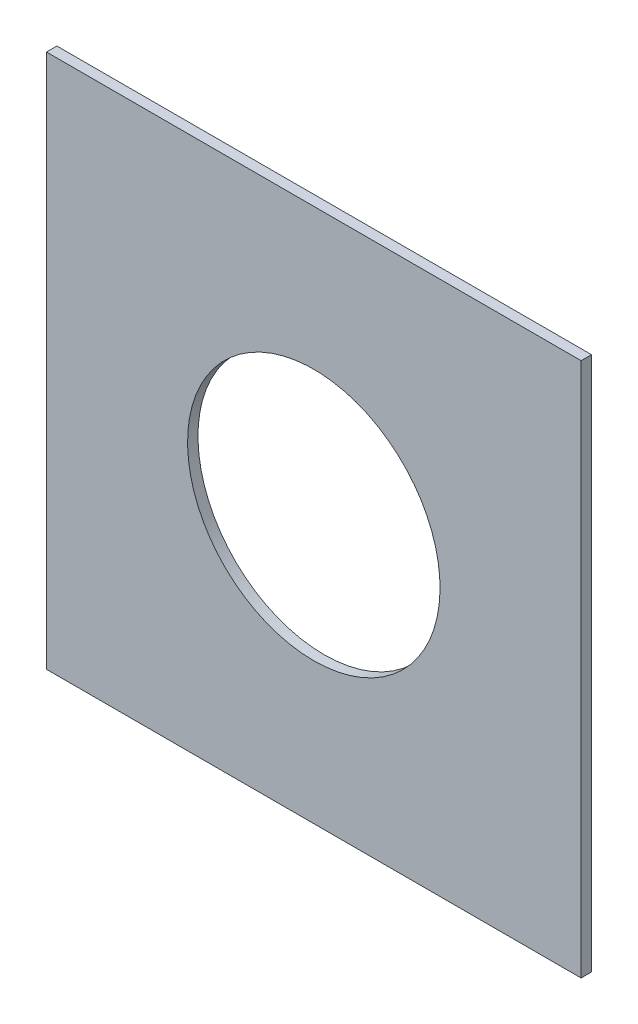
ISO-10303-21;
HEADER;
FILE_DESCRIPTION(('STEP AP214'),'2;1');
FILE_NAME('part.step','',(''),(''),'','','');
FILE_SCHEMA(('AUTOMOTIVE_DESIGN { 1 0 10303 214 1 1 1 1 }'));
ENDSEC;
DATA;
#1=APPLICATION_CONTEXT('core data for automotive mechanical design processes');
#2=APPLICATION_PROTOCOL_DEFINITION('international standard','automotive_design',2000,#1);
#3=PRODUCT_CONTEXT('',#1,'mechanical');
#4=PRODUCT('Part','Part','',(#3));
#5=PRODUCT_RELATED_PRODUCT_CATEGORY('part','',(#4));
#6=PRODUCT_DEFINITION_FORMATION('','',#4);
#7=PRODUCT_DEFINITION_CONTEXT('part definition',#1,'design');
#8=PRODUCT_DEFINITION('design','',#6,#7);
#9=PRODUCT_DEFINITION_SHAPE('','',#8);
#10=(LENGTH_UNIT() NAMED_UNIT(*) SI_UNIT(.MILLI.,.METRE.));
#11=(NAMED_UNIT(*) PLANE_ANGLE_UNIT() SI_UNIT($,.RADIAN.));
#12=(NAMED_UNIT(*) SI_UNIT($,.STERADIAN.) SOLID_ANGLE_UNIT());
#13=UNCERTAINTY_MEASURE_WITH_UNIT(LENGTH_MEASURE(1.E-05),#10,'distance_accuracy_value','');
#14=(GEOMETRIC_REPRESENTATION_CONTEXT(3) GLOBAL_UNCERTAINTY_ASSIGNED_CONTEXT((#13)) GLOBAL_UNIT_ASSIGNED_CONTEXT((#10,
#11,#12)) REPRESENTATION_CONTEXT('',''));
#15=CARTESIAN_POINT('',(0.,0.,0.));
#16=DIRECTION('',(0.,0.,1.));
#17=DIRECTION('',(1.,0.,0.));
#18=AXIS2_PLACEMENT_3D('',#15,#16,#17);
#19=CARTESIAN_POINT('',(118.105,-153.249,-0.045));
#20=DIRECTION('',(0.,0.,-1.));
#21=DIRECTION('',(0.,-1.,0.));
#22=AXIS2_PLACEMENT_3D('',#19,#20,#21);
#23=CYLINDRICAL_SURFACE('',#22,0.425);
#24=CARTESIAN_POINT('',(118.105,-153.249,1.67));
#25=DIRECTION('',(0.,0.,-1.));
#26=DIRECTION('',(0.,-1.,0.));
#27=AXIS2_PLACEMENT_3D('',#24,#25,#26);
#28=CIRCLE('',#27,0.425);
#29=CARTESIAN_POINT('',(118.105,-153.674,1.67));
#30=VERTEX_POINT('',#29);
#31=EDGE_CURVE('E113',#30,#30,#28,.T.);
#32=ORIENTED_EDGE('',*,*,#31,.T.);
#33=DIRECTION('',(0.,0.,1.));
#34=VECTOR('',#33,1.);
#35=CARTESIAN_POINT('',(118.105,-153.674,-0.045));
#36=LINE('',#35,#34);
#37=CARTESIAN_POINT('',(118.105,-153.674,1.705));
#38=VERTEX_POINT('',#37);
#39=EDGE_CURVE('E11',#30,#38,#36,.T.);
#40=ORIENTED_EDGE('',*,*,#39,.T.);
#41=CARTESIAN_POINT('',(118.105,-153.249,1.705));
#42=DIRECTION('',(0.,0.,-1.));
#43=DIRECTION('',(0.,-1.,0.));
#44=AXIS2_PLACEMENT_3D('',#41,#42,#43);
#45=CIRCLE('',#44,0.425);
#46=EDGE_CURVE('E25',#38,#38,#45,.T.);
#47=ORIENTED_EDGE('',*,*,#46,.F.);
#48=ORIENTED_EDGE('',*,*,#39,.F.);
#49=EDGE_LOOP('',(#32,#40,#47,#48));
#50=FACE_BOUND('',#49,.T.);
#51=ADVANCED_FACE('F17',(#50),#23,.F.);
#52=CARTESIAN_POINT('',(117.205,-152.349,1.67));
#53=DIRECTION('',(0.,1.,0.));
#54=DIRECTION('',(1.,0.,0.));
#55=AXIS2_PLACEMENT_3D('',#52,#53,#54);
#56=PLANE('',#55);
#57=DIRECTION('',(0.,0.,1.));
#58=VECTOR('',#57,1.);
#59=CARTESIAN_POINT('',(117.205,-152.349,1.67));
#60=LINE('',#59,#58);
#61=CARTESIAN_POINT('',(117.205,-152.349,1.67));
#62=VERTEX_POINT('',#61);
#63=CARTESIAN_POINT('',(117.205,-152.349,1.705));
#64=VERTEX_POINT('',#63);
#65=EDGE_CURVE('E122',#62,#64,#60,.T.);
#66=ORIENTED_EDGE('',*,*,#65,.T.);
#67=DIRECTION('',(1.,0.,0.));
#68=VECTOR('',#67,1.);
#69=CARTESIAN_POINT('',(117.205,-152.349,1.705));
#70=LINE('',#69,#68);
#71=CARTESIAN_POINT('',(119.005,-152.349,1.705));
#72=VERTEX_POINT('',#71);
#73=EDGE_CURVE('E111',#64,#72,#70,.T.);
#74=ORIENTED_EDGE('',*,*,#73,.T.);
#75=DIRECTION('',(0.,0.,1.));
#76=VECTOR('',#75,1.);
#77=CARTESIAN_POINT('',(119.005,-152.349,1.67));
#78=LINE('',#77,#76);
#79=CARTESIAN_POINT('',(119.005,-152.349,1.67));
#80=VERTEX_POINT('',#79);
#81=EDGE_CURVE('E97',#80,#72,#78,.T.);
#82=ORIENTED_EDGE('',*,*,#81,.F.);
#83=DIRECTION('',(1.,0.,0.));
#84=VECTOR('',#83,1.);
#85=CARTESIAN_POINT('',(117.205,-152.349,1.67));
#86=LINE('',#85,#84);
#87=EDGE_CURVE('E80',#62,#80,#86,.T.);
#88=ORIENTED_EDGE('',*,*,#87,.F.);
#89=EDGE_LOOP('',(#66,#74,#82,#88));
#90=FACE_BOUND('',#89,.T.);
#91=ADVANCED_FACE('F151',(#90),#56,.T.);
#92=CARTESIAN_POINT('',(0.,0.,1.705));
#93=DIRECTION('',(0.,0.,1.));
#94=DIRECTION('',(1.,0.,0.));
#95=AXIS2_PLACEMENT_3D('',#92,#93,#94);
#96=PLANE('',#95);
#97=ORIENTED_EDGE('',*,*,#46,.T.);
#98=EDGE_LOOP('',(#97));
#99=FACE_BOUND('',#98,.T.);
#100=DIRECTION('',(-1.,0.,0.));
#101=VECTOR('',#100,1.);
#102=CARTESIAN_POINT('',(119.005,-154.149,1.705));
#103=LINE('',#102,#101);
#104=CARTESIAN_POINT('',(119.005,-154.149,1.705));
#105=VERTEX_POINT('',#104);
#106=CARTESIAN_POINT('',(117.205,-154.149,1.705));
#107=VERTEX_POINT('',#106);
#108=EDGE_CURVE('E103',#105,#107,#103,.T.);
#109=ORIENTED_EDGE('',*,*,#108,.F.);
#110=DIRECTION('',(0.,-1.,0.));
#111=VECTOR('',#110,1.);
#112=CARTESIAN_POINT('',(119.005,-152.349,1.705));
#113=LINE('',#112,#111);
#114=EDGE_CURVE('E87',#72,#105,#113,.T.);
#115=ORIENTED_EDGE('',*,*,#114,.F.);
#116=ORIENTED_EDGE('',*,*,#73,.F.);
#117=DIRECTION('',(0.,1.,0.));
#118=VECTOR('',#117,1.);
#119=CARTESIAN_POINT('',(117.205,-154.149,1.705));
#120=LINE('',#119,#118);
#121=EDGE_CURVE('E86',#107,#64,#120,.T.);
#122=ORIENTED_EDGE('',*,*,#121,.F.);
#123=EDGE_LOOP('',(#109,#115,#116,#122));
#124=FACE_BOUND('',#123,.T.);
#125=ADVANCED_FACE('F141',(#99,#124),#96,.T.);
#126=CARTESIAN_POINT('',(0.,0.,1.67));
#127=DIRECTION('',(0.,0.,1.));
#128=DIRECTION('',(1.,0.,0.));
#129=AXIS2_PLACEMENT_3D('',#126,#127,#128);
#130=PLANE('',#129);
#131=ORIENTED_EDGE('',*,*,#31,.F.);
#132=EDGE_LOOP('',(#131));
#133=FACE_BOUND('',#132,.T.);
#134=DIRECTION('',(0.,1.,0.));
#135=VECTOR('',#134,1.);
#136=CARTESIAN_POINT('',(117.205,-154.149,1.67));
#137=LINE('',#136,#135);
#138=CARTESIAN_POINT('',(117.205,-154.149,1.67));
#139=VERTEX_POINT('',#138);
#140=EDGE_CURVE('E116',#139,#62,#137,.T.);
#141=ORIENTED_EDGE('',*,*,#140,.T.);
#142=ORIENTED_EDGE('',*,*,#87,.T.);
#143=DIRECTION('',(0.,-1.,0.));
#144=VECTOR('',#143,1.);
#145=CARTESIAN_POINT('',(119.005,-152.349,1.67));
#146=LINE('',#145,#144);
#147=CARTESIAN_POINT('',(119.005,-154.149,1.67));
#148=VERTEX_POINT('',#147);
#149=EDGE_CURVE('E74',#80,#148,#146,.T.);
#150=ORIENTED_EDGE('',*,*,#149,.T.);
#151=DIRECTION('',(-1.,0.,0.));
#152=VECTOR('',#151,1.);
#153=CARTESIAN_POINT('',(119.005,-154.149,1.67));
#154=LINE('',#153,#152);
#155=EDGE_CURVE('E78',#148,#139,#154,.T.);
#156=ORIENTED_EDGE('',*,*,#155,.T.);
#157=EDGE_LOOP('',(#141,#142,#150,#156));
#158=FACE_BOUND('',#157,.T.);
#159=ADVANCED_FACE('F77',(#133,#158),#130,.F.);
#160=CARTESIAN_POINT('',(117.205,-154.149,1.67));
#161=DIRECTION('',(-1.,0.,0.));
#162=DIRECTION('',(0.,0.,1.));
#163=AXIS2_PLACEMENT_3D('',#160,#161,#162);
#164=PLANE('',#163);
#165=DIRECTION('',(0.,0.,1.));
#166=VECTOR('',#165,1.);
#167=CARTESIAN_POINT('',(117.205,-154.149,1.67));
#168=LINE('',#167,#166);
#169=EDGE_CURVE('E95',#139,#107,#168,.T.);
#170=ORIENTED_EDGE('',*,*,#169,.T.);
#171=ORIENTED_EDGE('',*,*,#121,.T.);
#172=ORIENTED_EDGE('',*,*,#65,.F.);
#173=ORIENTED_EDGE('',*,*,#140,.F.);
#174=EDGE_LOOP('',(#170,#171,#172,#173));
#175=FACE_BOUND('',#174,.T.);
#176=ADVANCED_FACE('F140',(#175),#164,.T.);
#177=CARTESIAN_POINT('',(119.005,-152.349,1.67));
#178=DIRECTION('',(1.,0.,0.));
#179=DIRECTION('',(0.,1.,0.));
#180=AXIS2_PLACEMENT_3D('',#177,#178,#179);
#181=PLANE('',#180);
#182=ORIENTED_EDGE('',*,*,#81,.T.);
#183=ORIENTED_EDGE('',*,*,#114,.T.);
#184=DIRECTION('',(0.,0.,1.));
#185=VECTOR('',#184,1.);
#186=CARTESIAN_POINT('',(119.005,-154.149,1.67));
#187=LINE('',#186,#185);
#188=EDGE_CURVE('E93',#148,#105,#187,.T.);
#189=ORIENTED_EDGE('',*,*,#188,.F.);
#190=ORIENTED_EDGE('',*,*,#149,.F.);
#191=EDGE_LOOP('',(#182,#183,#189,#190));
#192=FACE_BOUND('',#191,.T.);
#193=ADVANCED_FACE('F99',(#192),#181,.T.);
#194=CARTESIAN_POINT('',(119.005,-154.149,1.67));
#195=DIRECTION('',(0.,-1.,0.));
#196=DIRECTION('',(0.,0.,-1.));
#197=AXIS2_PLACEMENT_3D('',#194,#195,#196);
#198=PLANE('',#197);
#199=ORIENTED_EDGE('',*,*,#188,.T.);
#200=ORIENTED_EDGE('',*,*,#108,.T.);
#201=ORIENTED_EDGE('',*,*,#169,.F.);
#202=ORIENTED_EDGE('',*,*,#155,.F.);
#203=EDGE_LOOP('',(#199,#200,#201,#202));
#204=FACE_BOUND('',#203,.T.);
#205=ADVANCED_FACE('F91',(#204),#198,.T.);
#206=CLOSED_SHELL('',(#51,#91,#125,#159,#176,#193,#205));
#207=MANIFOLD_SOLID_BREP('B1',#206);
#208=ADVANCED_BREP_SHAPE_REPRESENTATION('',(#18,#207),#14);
#209=SHAPE_DEFINITION_REPRESENTATION(#9,#208);
ENDSEC;
END-ISO-10303-21;
